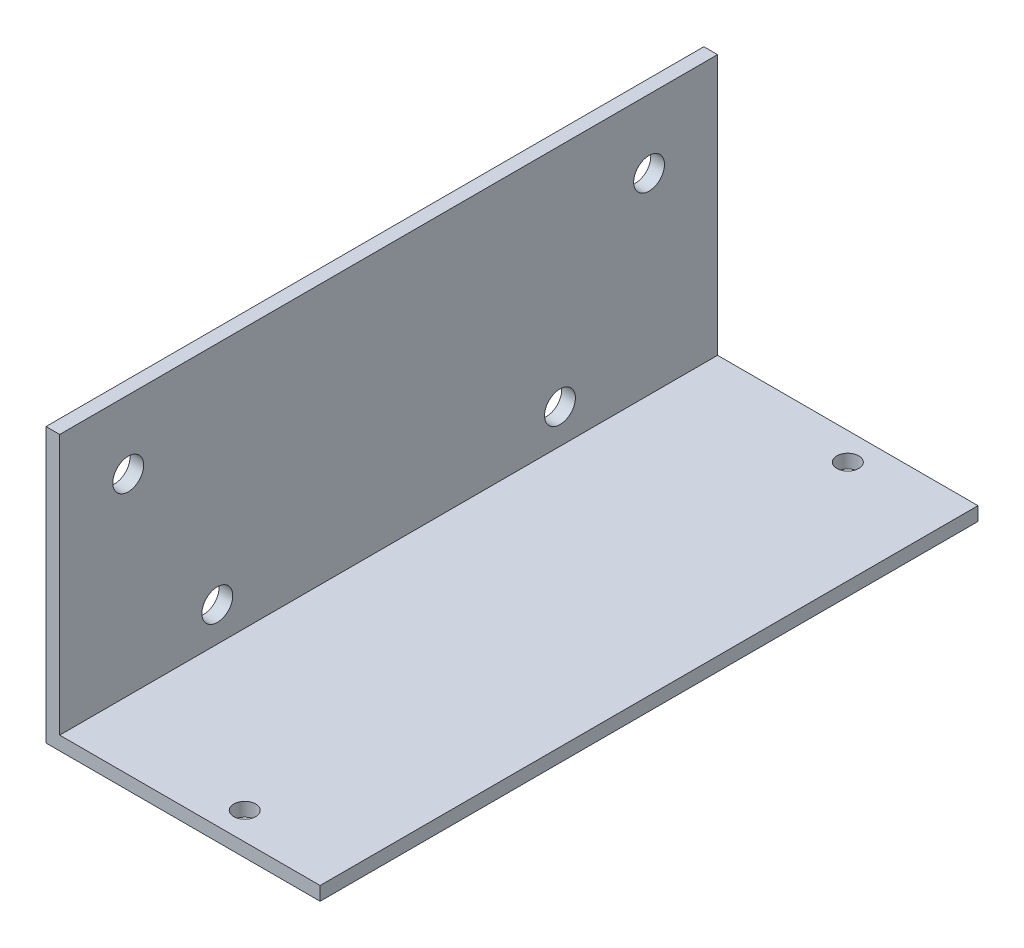
ISO-10303-21;
HEADER;
FILE_DESCRIPTION(('STEP AP214'),'2;1');
FILE_NAME('part.step','',(''),(''),'','','');
FILE_SCHEMA(('AUTOMOTIVE_DESIGN { 1 0 10303 214 1 1 1 1 }'));
ENDSEC;
DATA;
#1=APPLICATION_CONTEXT('core data for automotive mechanical design processes');
#2=APPLICATION_PROTOCOL_DEFINITION('international standard','automotive_design',2000,#1);
#3=PRODUCT_CONTEXT('',#1,'mechanical');
#4=PRODUCT('Part','Part','',(#3));
#5=PRODUCT_RELATED_PRODUCT_CATEGORY('part','',(#4));
#6=PRODUCT_DEFINITION_FORMATION('','',#4);
#7=PRODUCT_DEFINITION_CONTEXT('part definition',#1,'design');
#8=PRODUCT_DEFINITION('design','',#6,#7);
#9=PRODUCT_DEFINITION_SHAPE('','',#8);
#10=(LENGTH_UNIT() NAMED_UNIT(*) SI_UNIT(.MILLI.,.METRE.));
#11=(NAMED_UNIT(*) PLANE_ANGLE_UNIT() SI_UNIT($,.RADIAN.));
#12=(NAMED_UNIT(*) SI_UNIT($,.STERADIAN.) SOLID_ANGLE_UNIT());
#13=UNCERTAINTY_MEASURE_WITH_UNIT(LENGTH_MEASURE(1.E-05),#10,'distance_accuracy_value','');
#14=(GEOMETRIC_REPRESENTATION_CONTEXT(3) GLOBAL_UNCERTAINTY_ASSIGNED_CONTEXT((#13)) GLOBAL_UNIT_ASSIGNED_CONTEXT((#10,
#11,#12)) REPRESENTATION_CONTEXT('',''));
#15=CARTESIAN_POINT('',(0.,0.,0.));
#16=DIRECTION('',(0.,0.,1.));
#17=DIRECTION('',(1.,0.,0.));
#18=AXIS2_PLACEMENT_3D('',#15,#16,#17);
#19=CARTESIAN_POINT('',(0.,40.,96.));
#20=DIRECTION('',(1.,0.,0.));
#21=DIRECTION('',(0.,1.,0.));
#22=AXIS2_PLACEMENT_3D('',#19,#20,#21);
#23=PLANE('',#22);
#24=CARTESIAN_POINT('',(0.,6.99999999999999,23.));
#25=DIRECTION('',(-1.,0.,0.));
#26=DIRECTION('',(0.,-1.,0.));
#27=AXIS2_PLACEMENT_3D('',#24,#25,#26);
#28=CIRCLE('',#27,2.25);
#29=CARTESIAN_POINT('',(0.,4.74999999999999,23.));
#30=VERTEX_POINT('',#29);
#31=EDGE_CURVE('E166',#30,#30,#28,.T.);
#32=ORIENTED_EDGE('',*,*,#31,.F.);
#33=EDGE_LOOP('',(#32));
#34=FACE_BOUND('',#33,.T.);
#35=CARTESIAN_POINT('',(0.,7.,73.));
#36=DIRECTION('',(-1.,0.,0.));
#37=DIRECTION('',(0.,-1.,0.));
#38=AXIS2_PLACEMENT_3D('',#35,#36,#37);
#39=CIRCLE('',#38,2.25);
#40=CARTESIAN_POINT('',(0.,4.75,73.));
#41=VERTEX_POINT('',#40);
#42=EDGE_CURVE('E156',#41,#41,#39,.T.);
#43=ORIENTED_EDGE('',*,*,#42,.F.);
#44=EDGE_LOOP('',(#43));
#45=FACE_BOUND('',#44,.T.);
#46=CARTESIAN_POINT('',(0.,30.,9.99999999999999));
#47=DIRECTION('',(-1.,0.,0.));
#48=DIRECTION('',(0.,-1.,0.));
#49=AXIS2_PLACEMENT_3D('',#46,#47,#48);
#50=CIRCLE('',#49,2.25);
#51=CARTESIAN_POINT('',(0.,27.75,9.99999999999999));
#52=VERTEX_POINT('',#51);
#53=EDGE_CURVE('E153',#52,#52,#50,.T.);
#54=ORIENTED_EDGE('',*,*,#53,.F.);
#55=EDGE_LOOP('',(#54));
#56=FACE_BOUND('',#55,.T.);
#57=CARTESIAN_POINT('',(0.,30.,86.));
#58=DIRECTION('',(-1.,0.,0.));
#59=DIRECTION('',(0.,-1.,0.));
#60=AXIS2_PLACEMENT_3D('',#57,#58,#59);
#61=CIRCLE('',#60,2.25);
#62=CARTESIAN_POINT('',(0.,27.75,86.));
#63=VERTEX_POINT('',#62);
#64=EDGE_CURVE('E150',#63,#63,#61,.T.);
#65=ORIENTED_EDGE('',*,*,#64,.F.);
#66=EDGE_LOOP('',(#65));
#67=FACE_BOUND('',#66,.T.);
#68=DIRECTION('',(0.,-1.,0.));
#69=VECTOR('',#68,1.);
#70=CARTESIAN_POINT('',(0.,40.,0.));
#71=LINE('',#70,#69);
#72=CARTESIAN_POINT('',(0.,40.,0.));
#73=VERTEX_POINT('',#72);
#74=CARTESIAN_POINT('',(0.,0.,0.));
#75=VERTEX_POINT('',#74);
#76=EDGE_CURVE('E123',#73,#75,#71,.T.);
#77=ORIENTED_EDGE('',*,*,#76,.T.);
#78=DIRECTION('',(0.,0.,-1.));
#79=VECTOR('',#78,1.);
#80=CARTESIAN_POINT('',(0.,0.,96.));
#81=LINE('',#80,#79);
#82=CARTESIAN_POINT('',(0.,0.,96.));
#83=VERTEX_POINT('',#82);
#84=EDGE_CURVE('E11',#83,#75,#81,.T.);
#85=ORIENTED_EDGE('',*,*,#84,.F.);
#86=DIRECTION('',(0.,-1.,0.));
#87=VECTOR('',#86,1.);
#88=CARTESIAN_POINT('',(0.,40.,96.));
#89=LINE('',#88,#87);
#90=CARTESIAN_POINT('',(0.,40.,96.));
#91=VERTEX_POINT('',#90);
#92=EDGE_CURVE('E134',#91,#83,#89,.T.);
#93=ORIENTED_EDGE('',*,*,#92,.F.);
#94=DIRECTION('',(0.,0.,-1.));
#95=VECTOR('',#94,1.);
#96=CARTESIAN_POINT('',(0.,40.,96.));
#97=LINE('',#96,#95);
#98=EDGE_CURVE('E119',#91,#73,#97,.T.);
#99=ORIENTED_EDGE('',*,*,#98,.T.);
#100=EDGE_LOOP('',(#77,#85,#93,#99));
#101=FACE_BOUND('',#100,.T.);
#102=ADVANCED_FACE('F37',(#34,#45,#56,#67,#101),#23,.F.);
#103=CARTESIAN_POINT('',(0.,0.,96.));
#104=DIRECTION('',(0.,1.,0.));
#105=DIRECTION('',(0.,0.,1.));
#106=AXIS2_PLACEMENT_3D('',#103,#104,#105);
#107=PLANE('',#106);
#108=CARTESIAN_POINT('',(25.,0.,92.));
#109=DIRECTION('',(0.,-1.,0.));
#110=DIRECTION('',(0.,0.,-1.));
#111=AXIS2_PLACEMENT_3D('',#108,#109,#110);
#112=CIRCLE('',#111,1.60000000000001);
#113=CARTESIAN_POINT('',(25.,0.,90.4));
#114=VERTEX_POINT('',#113);
#115=EDGE_CURVE('E146',#114,#114,#112,.T.);
#116=ORIENTED_EDGE('',*,*,#115,.F.);
#117=EDGE_LOOP('',(#116));
#118=FACE_BOUND('',#117,.T.);
#119=CARTESIAN_POINT('',(25.,0.,4.));
#120=DIRECTION('',(0.,-1.,0.));
#121=DIRECTION('',(0.,0.,-1.));
#122=AXIS2_PLACEMENT_3D('',#119,#120,#121);
#123=CIRCLE('',#122,1.6);
#124=CARTESIAN_POINT('',(25.,0.,2.4));
#125=VERTEX_POINT('',#124);
#126=EDGE_CURVE('E142',#125,#125,#123,.T.);
#127=ORIENTED_EDGE('',*,*,#126,.F.);
#128=EDGE_LOOP('',(#127));
#129=FACE_BOUND('',#128,.T.);
#130=DIRECTION('',(1.,0.,0.));
#131=VECTOR('',#130,1.);
#132=CARTESIAN_POINT('',(0.,0.,0.));
#133=LINE('',#132,#131);
#134=CARTESIAN_POINT('',(40.,0.,0.));
#135=VERTEX_POINT('',#134);
#136=EDGE_CURVE('E126',#75,#135,#133,.T.);
#137=ORIENTED_EDGE('',*,*,#136,.T.);
#138=DIRECTION('',(0.,0.,-1.));
#139=VECTOR('',#138,1.);
#140=CARTESIAN_POINT('',(40.,0.,96.));
#141=LINE('',#140,#139);
#142=CARTESIAN_POINT('',(40.,0.,96.));
#143=VERTEX_POINT('',#142);
#144=EDGE_CURVE('E46',#143,#135,#141,.T.);
#145=ORIENTED_EDGE('',*,*,#144,.F.);
#146=DIRECTION('',(1.,0.,0.));
#147=VECTOR('',#146,1.);
#148=CARTESIAN_POINT('',(0.,0.,96.));
#149=LINE('',#148,#147);
#150=EDGE_CURVE('E92',#83,#143,#149,.T.);
#151=ORIENTED_EDGE('',*,*,#150,.F.);
#152=ORIENTED_EDGE('',*,*,#84,.T.);
#153=EDGE_LOOP('',(#137,#145,#151,#152));
#154=FACE_BOUND('',#153,.T.);
#155=ADVANCED_FACE('F178',(#118,#129,#154),#107,.F.);
#156=CARTESIAN_POINT('',(40.,0.,96.));
#157=DIRECTION('',(-1.,0.,0.));
#158=DIRECTION('',(0.,0.,1.));
#159=AXIS2_PLACEMENT_3D('',#156,#157,#158);
#160=PLANE('',#159);
#161=DIRECTION('',(0.,1.,0.));
#162=VECTOR('',#161,1.);
#163=CARTESIAN_POINT('',(40.,0.,0.));
#164=LINE('',#163,#162);
#165=CARTESIAN_POINT('',(40.,2.,0.));
#166=VERTEX_POINT('',#165);
#167=EDGE_CURVE('E129',#135,#166,#164,.T.);
#168=ORIENTED_EDGE('',*,*,#167,.T.);
#169=DIRECTION('',(0.,0.,-1.));
#170=VECTOR('',#169,1.);
#171=CARTESIAN_POINT('',(40.,2.,96.));
#172=LINE('',#171,#170);
#173=CARTESIAN_POINT('',(40.,2.,96.));
#174=VERTEX_POINT('',#173);
#175=EDGE_CURVE('E114',#174,#166,#172,.T.);
#176=ORIENTED_EDGE('',*,*,#175,.F.);
#177=DIRECTION('',(0.,1.,0.));
#178=VECTOR('',#177,1.);
#179=CARTESIAN_POINT('',(40.,0.,96.));
#180=LINE('',#179,#178);
#181=EDGE_CURVE('E105',#143,#174,#180,.T.);
#182=ORIENTED_EDGE('',*,*,#181,.F.);
#183=ORIENTED_EDGE('',*,*,#144,.T.);
#184=EDGE_LOOP('',(#168,#176,#182,#183));
#185=FACE_BOUND('',#184,.T.);
#186=ADVANCED_FACE('F181',(#185),#160,.F.);
#187=CARTESIAN_POINT('',(40.,2.,96.));
#188=DIRECTION('',(0.,-1.,0.));
#189=DIRECTION('',(1.,0.,0.));
#190=AXIS2_PLACEMENT_3D('',#187,#188,#189);
#191=PLANE('',#190);
#192=CARTESIAN_POINT('',(25.,2.,92.));
#193=DIRECTION('',(0.,-1.,0.));
#194=DIRECTION('',(1.,0.,0.));
#195=AXIS2_PLACEMENT_3D('',#192,#193,#194);
#196=CIRCLE('',#195,1.60000000000001);
#197=CARTESIAN_POINT('',(26.6,2.,92.));
#198=VERTEX_POINT('',#197);
#199=EDGE_CURVE('E143',#198,#198,#196,.T.);
#200=ORIENTED_EDGE('',*,*,#199,.T.);
#201=EDGE_LOOP('',(#200));
#202=FACE_BOUND('',#201,.T.);
#203=CARTESIAN_POINT('',(25.,2.,4.));
#204=DIRECTION('',(0.,-1.,0.));
#205=DIRECTION('',(1.,0.,0.));
#206=AXIS2_PLACEMENT_3D('',#203,#204,#205);
#207=CIRCLE('',#206,1.6);
#208=CARTESIAN_POINT('',(26.6,2.,4.));
#209=VERTEX_POINT('',#208);
#210=EDGE_CURVE('E127',#209,#209,#207,.T.);
#211=ORIENTED_EDGE('',*,*,#210,.T.);
#212=EDGE_LOOP('',(#211));
#213=FACE_BOUND('',#212,.T.);
#214=DIRECTION('',(-1.,0.,0.));
#215=VECTOR('',#214,1.);
#216=CARTESIAN_POINT('',(40.,2.,0.));
#217=LINE('',#216,#215);
#218=CARTESIAN_POINT('',(2.,2.,0.));
#219=VERTEX_POINT('',#218);
#220=EDGE_CURVE('E113',#166,#219,#217,.T.);
#221=ORIENTED_EDGE('',*,*,#220,.T.);
#222=DIRECTION('',(0.,0.,-1.));
#223=VECTOR('',#222,1.);
#224=CARTESIAN_POINT('',(2.,2.,96.));
#225=LINE('',#224,#223);
#226=CARTESIAN_POINT('',(2.,2.,96.));
#227=VERTEX_POINT('',#226);
#228=EDGE_CURVE('E110',#227,#219,#225,.T.);
#229=ORIENTED_EDGE('',*,*,#228,.F.);
#230=DIRECTION('',(-1.,0.,0.));
#231=VECTOR('',#230,1.);
#232=CARTESIAN_POINT('',(40.,2.,96.));
#233=LINE('',#232,#231);
#234=EDGE_CURVE('E99',#174,#227,#233,.T.);
#235=ORIENTED_EDGE('',*,*,#234,.F.);
#236=ORIENTED_EDGE('',*,*,#175,.T.);
#237=EDGE_LOOP('',(#221,#229,#235,#236));
#238=FACE_BOUND('',#237,.T.);
#239=ADVANCED_FACE('F111',(#202,#213,#238),#191,.F.);
#240=CARTESIAN_POINT('',(2.,2.,96.));
#241=DIRECTION('',(-1.,0.,0.));
#242=DIRECTION('',(0.,-1.,0.));
#243=AXIS2_PLACEMENT_3D('',#240,#241,#242);
#244=PLANE('',#243);
#245=CARTESIAN_POINT('',(2.,6.99999999999999,23.));
#246=DIRECTION('',(-1.,0.,0.));
#247=DIRECTION('',(0.,-1.,0.));
#248=AXIS2_PLACEMENT_3D('',#245,#246,#247);
#249=CIRCLE('',#248,2.25);
#250=CARTESIAN_POINT('',(2.,4.74999999999999,23.));
#251=VERTEX_POINT('',#250);
#252=EDGE_CURVE('E40',#251,#251,#249,.T.);
#253=ORIENTED_EDGE('',*,*,#252,.T.);
#254=EDGE_LOOP('',(#253));
#255=FACE_BOUND('',#254,.T.);
#256=CARTESIAN_POINT('',(2.,7.,73.));
#257=DIRECTION('',(-1.,0.,0.));
#258=DIRECTION('',(0.,-1.,0.));
#259=AXIS2_PLACEMENT_3D('',#256,#257,#258);
#260=CIRCLE('',#259,2.25);
#261=CARTESIAN_POINT('',(2.,4.75,73.));
#262=VERTEX_POINT('',#261);
#263=EDGE_CURVE('E154',#262,#262,#260,.T.);
#264=ORIENTED_EDGE('',*,*,#263,.T.);
#265=EDGE_LOOP('',(#264));
#266=FACE_BOUND('',#265,.T.);
#267=CARTESIAN_POINT('',(2.,30.,9.99999999999999));
#268=DIRECTION('',(-1.,0.,0.));
#269=DIRECTION('',(0.,-1.,0.));
#270=AXIS2_PLACEMENT_3D('',#267,#268,#269);
#271=CIRCLE('',#270,2.25);
#272=CARTESIAN_POINT('',(2.,27.75,9.99999999999999));
#273=VERTEX_POINT('',#272);
#274=EDGE_CURVE('E151',#273,#273,#271,.T.);
#275=ORIENTED_EDGE('',*,*,#274,.T.);
#276=EDGE_LOOP('',(#275));
#277=FACE_BOUND('',#276,.T.);
#278=CARTESIAN_POINT('',(2.,30.,86.));
#279=DIRECTION('',(-1.,0.,0.));
#280=DIRECTION('',(0.,-1.,0.));
#281=AXIS2_PLACEMENT_3D('',#278,#279,#280);
#282=CIRCLE('',#281,2.25);
#283=CARTESIAN_POINT('',(2.,27.75,86.));
#284=VERTEX_POINT('',#283);
#285=EDGE_CURVE('E147',#284,#284,#282,.T.);
#286=ORIENTED_EDGE('',*,*,#285,.T.);
#287=EDGE_LOOP('',(#286));
#288=FACE_BOUND('',#287,.T.);
#289=DIRECTION('',(0.,1.,0.));
#290=VECTOR('',#289,1.);
#291=CARTESIAN_POINT('',(2.,2.,0.));
#292=LINE('',#291,#290);
#293=CARTESIAN_POINT('',(2.,40.,0.));
#294=VERTEX_POINT('',#293);
#295=EDGE_CURVE('E78',#219,#294,#292,.T.);
#296=ORIENTED_EDGE('',*,*,#295,.T.);
#297=DIRECTION('',(0.,0.,-1.));
#298=VECTOR('',#297,1.);
#299=CARTESIAN_POINT('',(2.,40.,96.));
#300=LINE('',#299,#298);
#301=CARTESIAN_POINT('',(2.,40.,96.));
#302=VERTEX_POINT('',#301);
#303=EDGE_CURVE('E115',#302,#294,#300,.T.);
#304=ORIENTED_EDGE('',*,*,#303,.F.);
#305=DIRECTION('',(0.,1.,0.));
#306=VECTOR('',#305,1.);
#307=CARTESIAN_POINT('',(2.,2.,96.));
#308=LINE('',#307,#306);
#309=EDGE_CURVE('E103',#227,#302,#308,.T.);
#310=ORIENTED_EDGE('',*,*,#309,.F.);
#311=ORIENTED_EDGE('',*,*,#228,.T.);
#312=EDGE_LOOP('',(#296,#304,#310,#311));
#313=FACE_BOUND('',#312,.T.);
#314=ADVANCED_FACE('F117',(#255,#266,#277,#288,#313),#244,.F.);
#315=CARTESIAN_POINT('',(2.,40.,96.));
#316=DIRECTION('',(0.,-1.,0.));
#317=DIRECTION('',(0.,0.,-1.));
#318=AXIS2_PLACEMENT_3D('',#315,#316,#317);
#319=PLANE('',#318);
#320=DIRECTION('',(-1.,0.,0.));
#321=VECTOR('',#320,1.);
#322=CARTESIAN_POINT('',(2.,40.,0.));
#323=LINE('',#322,#321);
#324=EDGE_CURVE('E84',#294,#73,#323,.T.);
#325=ORIENTED_EDGE('',*,*,#324,.T.);
#326=ORIENTED_EDGE('',*,*,#98,.F.);
#327=DIRECTION('',(-1.,0.,0.));
#328=VECTOR('',#327,1.);
#329=CARTESIAN_POINT('',(2.,40.,96.));
#330=LINE('',#329,#328);
#331=EDGE_CURVE('E55',#302,#91,#330,.T.);
#332=ORIENTED_EDGE('',*,*,#331,.F.);
#333=ORIENTED_EDGE('',*,*,#303,.T.);
#334=EDGE_LOOP('',(#325,#326,#332,#333));
#335=FACE_BOUND('',#334,.T.);
#336=ADVANCED_FACE('F186',(#335),#319,.F.);
#337=CARTESIAN_POINT('',(0.,0.,96.));
#338=DIRECTION('',(0.,0.,1.));
#339=DIRECTION('',(1.,0.,0.));
#340=AXIS2_PLACEMENT_3D('',#337,#338,#339);
#341=PLANE('',#340);
#342=ORIENTED_EDGE('',*,*,#92,.T.);
#343=ORIENTED_EDGE('',*,*,#150,.T.);
#344=ORIENTED_EDGE('',*,*,#181,.T.);
#345=ORIENTED_EDGE('',*,*,#234,.T.);
#346=ORIENTED_EDGE('',*,*,#309,.T.);
#347=ORIENTED_EDGE('',*,*,#331,.T.);
#348=EDGE_LOOP('',(#342,#343,#344,#345,#346,#347));
#349=FACE_BOUND('',#348,.T.);
#350=ADVANCED_FACE('F101',(#349),#341,.T.);
#351=CARTESIAN_POINT('',(0.,0.,0.));
#352=DIRECTION('',(0.,0.,1.));
#353=DIRECTION('',(1.,0.,0.));
#354=AXIS2_PLACEMENT_3D('',#351,#352,#353);
#355=PLANE('',#354);
#356=ORIENTED_EDGE('',*,*,#76,.F.);
#357=ORIENTED_EDGE('',*,*,#324,.F.);
#358=ORIENTED_EDGE('',*,*,#295,.F.);
#359=ORIENTED_EDGE('',*,*,#220,.F.);
#360=ORIENTED_EDGE('',*,*,#167,.F.);
#361=ORIENTED_EDGE('',*,*,#136,.F.);
#362=EDGE_LOOP('',(#356,#357,#358,#359,#360,#361));
#363=FACE_BOUND('',#362,.T.);
#364=ADVANCED_FACE('F184',(#363),#355,.F.);
#365=CARTESIAN_POINT('',(25.,40.,4.));
#366=DIRECTION('',(0.,-1.,0.));
#367=DIRECTION('',(0.,0.,-1.));
#368=AXIS2_PLACEMENT_3D('',#365,#366,#367);
#369=CYLINDRICAL_SURFACE('',#368,1.6);
#370=ORIENTED_EDGE('',*,*,#126,.T.);
#371=EDGE_LOOP('',(#370));
#372=FACE_BOUND('',#371,.T.);
#373=ORIENTED_EDGE('',*,*,#210,.F.);
#374=EDGE_LOOP('',(#373));
#375=FACE_BOUND('',#374,.T.);
#376=ADVANCED_FACE('F226',(#372,#375),#369,.F.);
#377=CARTESIAN_POINT('',(25.,40.,92.));
#378=DIRECTION('',(0.,-1.,0.));
#379=DIRECTION('',(0.,0.,-1.));
#380=AXIS2_PLACEMENT_3D('',#377,#378,#379);
#381=CYLINDRICAL_SURFACE('',#380,1.60000000000001);
#382=ORIENTED_EDGE('',*,*,#115,.T.);
#383=EDGE_LOOP('',(#382));
#384=FACE_BOUND('',#383,.T.);
#385=ORIENTED_EDGE('',*,*,#199,.F.);
#386=EDGE_LOOP('',(#385));
#387=FACE_BOUND('',#386,.T.);
#388=ADVANCED_FACE('F215',(#384,#387),#381,.F.);
#389=CARTESIAN_POINT('',(40.,30.,86.));
#390=DIRECTION('',(-1.,0.,0.));
#391=DIRECTION('',(0.,-1.,0.));
#392=AXIS2_PLACEMENT_3D('',#389,#390,#391);
#393=CYLINDRICAL_SURFACE('',#392,2.25);
#394=ORIENTED_EDGE('',*,*,#64,.T.);
#395=EDGE_LOOP('',(#394));
#396=FACE_BOUND('',#395,.T.);
#397=ORIENTED_EDGE('',*,*,#285,.F.);
#398=EDGE_LOOP('',(#397));
#399=FACE_BOUND('',#398,.T.);
#400=ADVANCED_FACE('F211',(#396,#399),#393,.F.);
#401=CARTESIAN_POINT('',(40.,30.,9.99999999999999));
#402=DIRECTION('',(-1.,0.,0.));
#403=DIRECTION('',(0.,-1.,0.));
#404=AXIS2_PLACEMENT_3D('',#401,#402,#403);
#405=CYLINDRICAL_SURFACE('',#404,2.25);
#406=ORIENTED_EDGE('',*,*,#53,.T.);
#407=EDGE_LOOP('',(#406));
#408=FACE_BOUND('',#407,.T.);
#409=ORIENTED_EDGE('',*,*,#274,.F.);
#410=EDGE_LOOP('',(#409));
#411=FACE_BOUND('',#410,.T.);
#412=ADVANCED_FACE('F214',(#408,#411),#405,.F.);
#413=CARTESIAN_POINT('',(40.,6.99999999999999,73.));
#414=DIRECTION('',(-1.,0.,0.));
#415=DIRECTION('',(0.,-1.,0.));
#416=AXIS2_PLACEMENT_3D('',#413,#414,#415);
#417=CYLINDRICAL_SURFACE('',#416,2.25);
#418=ORIENTED_EDGE('',*,*,#42,.T.);
#419=EDGE_LOOP('',(#418));
#420=FACE_BOUND('',#419,.T.);
#421=ORIENTED_EDGE('',*,*,#263,.F.);
#422=EDGE_LOOP('',(#421));
#423=FACE_BOUND('',#422,.T.);
#424=ADVANCED_FACE('F223',(#420,#423),#417,.F.);
#425=CARTESIAN_POINT('',(40.,6.99999999999999,23.));
#426=DIRECTION('',(-1.,0.,0.));
#427=DIRECTION('',(0.,-1.,0.));
#428=AXIS2_PLACEMENT_3D('',#425,#426,#427);
#429=CYLINDRICAL_SURFACE('',#428,2.25);
#430=ORIENTED_EDGE('',*,*,#31,.T.);
#431=EDGE_LOOP('',(#430));
#432=FACE_BOUND('',#431,.T.);
#433=ORIENTED_EDGE('',*,*,#252,.F.);
#434=EDGE_LOOP('',(#433));
#435=FACE_BOUND('',#434,.T.);
#436=ADVANCED_FACE('F281',(#432,#435),#429,.F.);
#437=CLOSED_SHELL('',(#102,#155,#186,#239,#314,#336,#350,#364,#376,#388,#400,#412,#424,#436));
#438=MANIFOLD_SOLID_BREP('B2',#437);
#439=ADVANCED_BREP_SHAPE_REPRESENTATION('',(#18,#438),#14);
#440=SHAPE_DEFINITION_REPRESENTATION(#9,#439);
ENDSEC;
END-ISO-10303-21;
